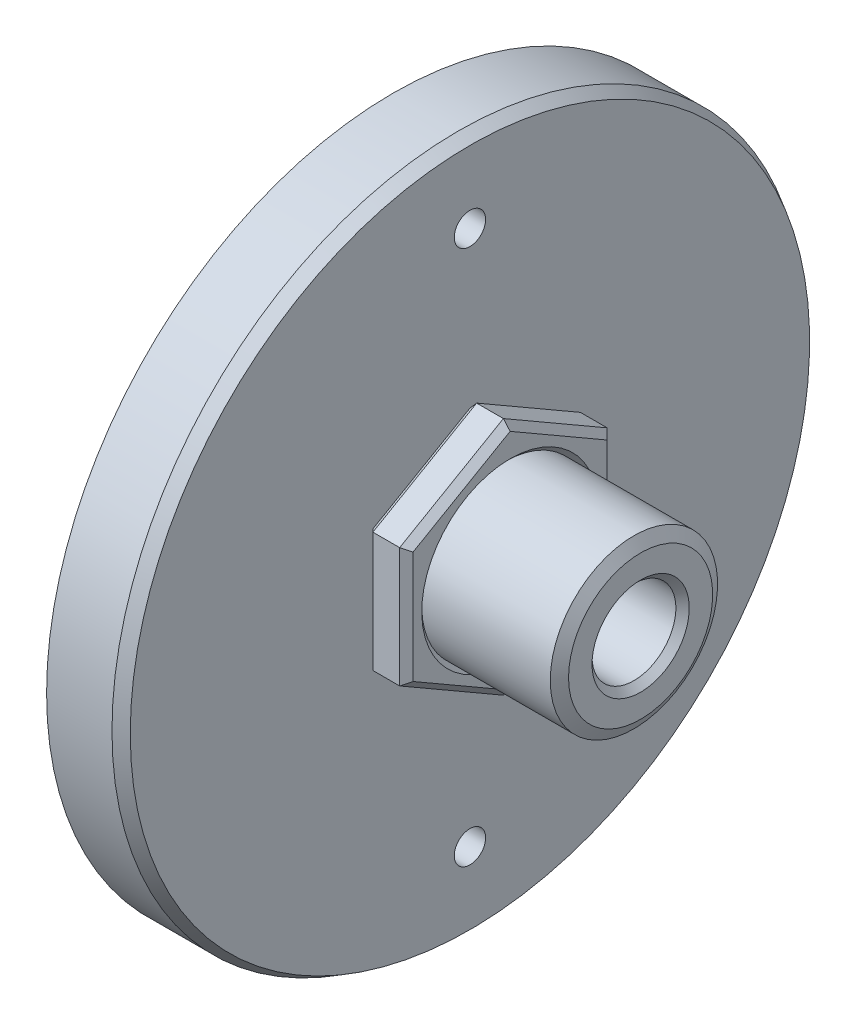
ISO-10303-21;
HEADER;
FILE_DESCRIPTION(('STEP AP214'),'2;1');
FILE_NAME('part.step','',(''),(''),'','','');
FILE_SCHEMA(('AUTOMOTIVE_DESIGN { 1 0 10303 214 1 1 1 1 }'));
ENDSEC;
DATA;
#1=APPLICATION_CONTEXT('core data for automotive mechanical design processes');
#2=APPLICATION_PROTOCOL_DEFINITION('international standard','automotive_design',2000,#1);
#3=PRODUCT_CONTEXT('',#1,'mechanical');
#4=PRODUCT('Part','Part','',(#3));
#5=PRODUCT_RELATED_PRODUCT_CATEGORY('part','',(#4));
#6=PRODUCT_DEFINITION_FORMATION('','',#4);
#7=PRODUCT_DEFINITION_CONTEXT('part definition',#1,'design');
#8=PRODUCT_DEFINITION('design','',#6,#7);
#9=PRODUCT_DEFINITION_SHAPE('','',#8);
#10=(LENGTH_UNIT() NAMED_UNIT(*) SI_UNIT(.MILLI.,.METRE.));
#11=(NAMED_UNIT(*) PLANE_ANGLE_UNIT() SI_UNIT($,.RADIAN.));
#12=(NAMED_UNIT(*) SI_UNIT($,.STERADIAN.) SOLID_ANGLE_UNIT());
#13=UNCERTAINTY_MEASURE_WITH_UNIT(LENGTH_MEASURE(1.E-05),#10,'distance_accuracy_value','');
#14=(GEOMETRIC_REPRESENTATION_CONTEXT(3) GLOBAL_UNCERTAINTY_ASSIGNED_CONTEXT((#13)) GLOBAL_UNIT_ASSIGNED_CONTEXT((#10,
#11,#12)) REPRESENTATION_CONTEXT('',''));
#15=CARTESIAN_POINT('',(0.,0.,0.));
#16=DIRECTION('',(0.,0.,1.));
#17=DIRECTION('',(1.,0.,0.));
#18=AXIS2_PLACEMENT_3D('',#15,#16,#17);
#19=CARTESIAN_POINT('',(0.,-4.54605601959911,0.));
#20=DIRECTION('',(0.,0.866025403784439,-0.499999999999999));
#21=DIRECTION('',(0.,-0.499999999999999,-0.866025403784439));
#22=AXIS2_PLACEMENT_3D('',#19,#20,#21);
#23=PLANE('',#22);
#24=DIRECTION('',(1.,0.,0.));
#25=VECTOR('',#24,1.);
#26=CARTESIAN_POINT('',(0.,-4.54605601959911,0.));
#27=LINE('',#26,#25);
#28=CARTESIAN_POINT('',(0.254000000000003,-4.54605601959911,0.));
#29=VERTEX_POINT('',#28);
#30=CARTESIAN_POINT('',(1.27,-4.54605601959911,0.));
#31=VERTEX_POINT('',#30);
#32=EDGE_CURVE('P0_E212',#29,#31,#27,.T.);
#33=ORIENTED_EDGE('',*,*,#32,.T.);
#34=DIRECTION('',(0.,0.499999999999999,0.866025403784439));
#35=VECTOR('',#34,1.);
#36=CARTESIAN_POINT('',(1.27,-4.54605601959911,0.));
#37=LINE('',#36,#35);
#38=CARTESIAN_POINT('',(1.27,-2.27302800979957,3.93699999999999));
#39=VERTEX_POINT('',#38);
#40=EDGE_CURVE('P0_E178',#31,#39,#37,.T.);
#41=ORIENTED_EDGE('',*,*,#40,.T.);
#42=DIRECTION('',(1.,0.,0.));
#43=VECTOR('',#42,1.);
#44=CARTESIAN_POINT('',(0.,-2.27302800979957,3.93699999999999));
#45=LINE('',#44,#43);
#46=CARTESIAN_POINT('',(0.254000000000003,-2.27302800979957,3.93699999999999));
#47=VERTEX_POINT('',#46);
#48=EDGE_CURVE('P0_E128',#47,#39,#45,.T.);
#49=ORIENTED_EDGE('',*,*,#48,.F.);
#50=DIRECTION('',(0.,-0.499999999999999,-0.866025403784439));
#51=VECTOR('',#50,1.);
#52=CARTESIAN_POINT('',(0.254000000000003,-4.54605601959911,0.));
#53=LINE('',#52,#51);
#54=EDGE_CURVE('P0_E176',#47,#29,#53,.T.);
#55=ORIENTED_EDGE('',*,*,#54,.T.);
#56=EDGE_LOOP('',(#33,#41,#49,#55));
#57=FACE_BOUND('',#56,.T.);
#58=ADVANCED_FACE('P0_F16',(#57),#23,.F.);
#59=CARTESIAN_POINT('',(0.,-2.27302800979957,3.93699999999999));
#60=DIRECTION('',(0.,0.,-1.));
#61=DIRECTION('',(0.,-1.,0.));
#62=AXIS2_PLACEMENT_3D('',#59,#60,#61);
#63=PLANE('',#62);
#64=ORIENTED_EDGE('',*,*,#48,.T.);
#65=DIRECTION('',(0.,1.,0.));
#66=VECTOR('',#65,1.);
#67=CARTESIAN_POINT('',(1.27,-2.27302800979957,3.93699999999999));
#68=LINE('',#67,#66);
#69=CARTESIAN_POINT('',(1.27,2.27302800979956,3.93699999999999));
#70=VERTEX_POINT('',#69);
#71=EDGE_CURVE('P0_E127',#39,#70,#68,.T.);
#72=ORIENTED_EDGE('',*,*,#71,.T.);
#73=DIRECTION('',(1.,0.,0.));
#74=VECTOR('',#73,1.);
#75=CARTESIAN_POINT('',(0.,2.27302800979956,3.93699999999999));
#76=LINE('',#75,#74);
#77=CARTESIAN_POINT('',(0.254000000000003,2.27302800979956,3.93699999999999));
#78=VERTEX_POINT('',#77);
#79=EDGE_CURVE('P0_E109',#78,#70,#76,.T.);
#80=ORIENTED_EDGE('',*,*,#79,.F.);
#81=DIRECTION('',(0.,-1.,0.));
#82=VECTOR('',#81,1.);
#83=CARTESIAN_POINT('',(0.254000000000003,-2.27302800979957,3.93699999999999));
#84=LINE('',#83,#82);
#85=EDGE_CURVE('P0_E124',#78,#47,#84,.T.);
#86=ORIENTED_EDGE('',*,*,#85,.T.);
#87=EDGE_LOOP('',(#64,#72,#80,#86));
#88=FACE_BOUND('',#87,.T.);
#89=ADVANCED_FACE('P0_F122',(#88),#63,.F.);
#90=CARTESIAN_POINT('',(0.,2.27302800979956,3.93699999999999));
#91=DIRECTION('',(0.,-0.866025403784438,-0.500000000000001));
#92=DIRECTION('',(1.,0.,0.));
#93=AXIS2_PLACEMENT_3D('',#90,#91,#92);
#94=PLANE('',#93);
#95=ORIENTED_EDGE('',*,*,#79,.T.);
#96=DIRECTION('',(0.,0.500000000000001,-0.866025403784438));
#97=VECTOR('',#96,1.);
#98=CARTESIAN_POINT('',(1.27,2.27302800979956,3.93699999999999));
#99=LINE('',#98,#97);
#100=CARTESIAN_POINT('',(1.27,4.54605601959912,0.));
#101=VERTEX_POINT('',#100);
#102=EDGE_CURVE('P0_E116',#70,#101,#99,.T.);
#103=ORIENTED_EDGE('',*,*,#102,.T.);
#104=DIRECTION('',(1.,0.,0.));
#105=VECTOR('',#104,1.);
#106=CARTESIAN_POINT('',(0.,4.54605601959912,0.));
#107=LINE('',#106,#105);
#108=CARTESIAN_POINT('',(0.254000000000003,4.54605601959912,0.));
#109=VERTEX_POINT('',#108);
#110=EDGE_CURVE('P0_E111',#109,#101,#107,.T.);
#111=ORIENTED_EDGE('',*,*,#110,.F.);
#112=DIRECTION('',(0.,-0.500000000000001,0.866025403784438));
#113=VECTOR('',#112,1.);
#114=CARTESIAN_POINT('',(0.254000000000003,2.27302800979956,3.93699999999999));
#115=LINE('',#114,#113);
#116=EDGE_CURVE('P0_E106',#109,#78,#115,.T.);
#117=ORIENTED_EDGE('',*,*,#116,.T.);
#118=EDGE_LOOP('',(#95,#103,#111,#117));
#119=FACE_BOUND('',#118,.T.);
#120=ADVANCED_FACE('P0_F108',(#119),#94,.F.);
#121=CARTESIAN_POINT('',(0.,4.54605601959912,0.));
#122=DIRECTION('',(0.,-0.866025403784439,0.499999999999999));
#123=DIRECTION('',(0.,0.499999999999999,0.866025403784439));
#124=AXIS2_PLACEMENT_3D('',#121,#122,#123);
#125=PLANE('',#124);
#126=ORIENTED_EDGE('',*,*,#110,.T.);
#127=DIRECTION('',(0.,-0.499999999999999,-0.866025403784439));
#128=VECTOR('',#127,1.);
#129=CARTESIAN_POINT('',(1.27,4.54605601959912,0.));
#130=LINE('',#129,#128);
#131=CARTESIAN_POINT('',(1.27,2.27302800979956,-3.937));
#132=VERTEX_POINT('',#131);
#133=EDGE_CURVE('P0_E165',#101,#132,#130,.T.);
#134=ORIENTED_EDGE('',*,*,#133,.T.);
#135=DIRECTION('',(1.,0.,0.));
#136=VECTOR('',#135,1.);
#137=CARTESIAN_POINT('',(0.,2.27302800979956,-3.937));
#138=LINE('',#137,#136);
#139=CARTESIAN_POINT('',(0.254000000000003,2.27302800979956,-3.937));
#140=VERTEX_POINT('',#139);
#141=EDGE_CURVE('P0_E230',#140,#132,#138,.T.);
#142=ORIENTED_EDGE('',*,*,#141,.F.);
#143=DIRECTION('',(0.,0.499999999999999,0.866025403784439));
#144=VECTOR('',#143,1.);
#145=CARTESIAN_POINT('',(0.254000000000003,4.54605601959912,0.));
#146=LINE('',#145,#144);
#147=EDGE_CURVE('P0_E163',#140,#109,#146,.T.);
#148=ORIENTED_EDGE('',*,*,#147,.T.);
#149=EDGE_LOOP('',(#126,#134,#142,#148));
#150=FACE_BOUND('',#149,.T.);
#151=ADVANCED_FACE('P0_F227',(#150),#125,.F.);
#152=CARTESIAN_POINT('',(0.,2.27302800979956,-3.937));
#153=DIRECTION('',(0.,0.,1.));
#154=DIRECTION('',(0.,1.,0.));
#155=AXIS2_PLACEMENT_3D('',#152,#153,#154);
#156=PLANE('',#155);
#157=ORIENTED_EDGE('',*,*,#141,.T.);
#158=DIRECTION('',(0.,-1.,0.));
#159=VECTOR('',#158,1.);
#160=CARTESIAN_POINT('',(1.27,2.27302800979956,-3.937));
#161=LINE('',#160,#159);
#162=CARTESIAN_POINT('',(1.27,-2.27302800979955,-3.93700000000001));
#163=VERTEX_POINT('',#162);
#164=EDGE_CURVE('P0_E169',#132,#163,#161,.T.);
#165=ORIENTED_EDGE('',*,*,#164,.T.);
#166=DIRECTION('',(1.,0.,0.));
#167=VECTOR('',#166,1.);
#168=CARTESIAN_POINT('',(0.,-2.27302800979955,-3.93700000000001));
#169=LINE('',#168,#167);
#170=CARTESIAN_POINT('',(0.254000000000003,-2.27302800979955,-3.93700000000001));
#171=VERTEX_POINT('',#170);
#172=EDGE_CURVE('P0_E233',#171,#163,#169,.T.);
#173=ORIENTED_EDGE('',*,*,#172,.F.);
#174=DIRECTION('',(0.,1.,0.));
#175=VECTOR('',#174,1.);
#176=CARTESIAN_POINT('',(0.254000000000003,2.27302800979956,-3.937));
#177=LINE('',#176,#175);
#178=EDGE_CURVE('P0_E167',#171,#140,#177,.T.);
#179=ORIENTED_EDGE('',*,*,#178,.T.);
#180=EDGE_LOOP('',(#157,#165,#173,#179));
#181=FACE_BOUND('',#180,.T.);
#182=ADVANCED_FACE('P0_F272',(#181),#156,.F.);
#183=CARTESIAN_POINT('',(0.,-2.27302800979955,-3.93700000000001));
#184=DIRECTION('',(0.,0.866025403784438,0.500000000000001));
#185=DIRECTION('',(0.,0.500000000000001,-0.866025403784438));
#186=AXIS2_PLACEMENT_3D('',#183,#184,#185);
#187=PLANE('',#186);
#188=ORIENTED_EDGE('',*,*,#172,.T.);
#189=DIRECTION('',(0.,-0.500000000000001,0.866025403784438));
#190=VECTOR('',#189,1.);
#191=CARTESIAN_POINT('',(1.27,-2.27302800979955,-3.93700000000001));
#192=LINE('',#191,#190);
#193=EDGE_CURVE('P0_E174',#163,#31,#192,.T.);
#194=ORIENTED_EDGE('',*,*,#193,.T.);
#195=ORIENTED_EDGE('',*,*,#32,.F.);
#196=DIRECTION('',(0.,0.500000000000001,-0.866025403784438));
#197=VECTOR('',#196,1.);
#198=CARTESIAN_POINT('',(0.254000000000003,-2.27302800979955,-3.93700000000001));
#199=LINE('',#198,#197);
#200=EDGE_CURVE('P0_E171',#29,#171,#199,.T.);
#201=ORIENTED_EDGE('',*,*,#200,.T.);
#202=EDGE_LOOP('',(#188,#194,#195,#201));
#203=FACE_BOUND('',#202,.T.);
#204=ADVANCED_FACE('P0_F273',(#203),#187,.F.);
#205=CARTESIAN_POINT('',(0.,-2.27302800979957,3.93699999999999));
#206=DIRECTION('',(-1.,0.,0.));
#207=DIRECTION('',(0.,-0.500000000000001,0.866025403784438));
#208=AXIS2_PLACEMENT_3D('',#205,#206,#207);
#209=PLANE('',#208);
#210=DIRECTION('',(0.,-1.,0.));
#211=VECTOR('',#210,1.);
#212=CARTESIAN_POINT('',(0.,-2.27302800979955,-3.68300000000001));
#213=LINE('',#212,#211);
#214=CARTESIAN_POINT('',(0.,2.1263810414254,-3.683));
#215=VERTEX_POINT('',#214);
#216=CARTESIAN_POINT('',(0.,-2.12638104142538,-3.68300000000001));
#217=VERTEX_POINT('',#216);
#218=EDGE_CURVE('P0_E25',#215,#217,#213,.T.);
#219=ORIENTED_EDGE('',*,*,#218,.T.);
#220=DIRECTION('',(0.,-0.500000000000001,0.866025403784438));
#221=VECTOR('',#220,1.);
#222=CARTESIAN_POINT('',(0.,-4.32608556703787,0.127000000000005));
#223=LINE('',#222,#221);
#224=CARTESIAN_POINT('',(0.,-4.25276208285078,0.));
#225=VERTEX_POINT('',#224);
#226=EDGE_CURVE('P0_E11',#217,#225,#223,.T.);
#227=ORIENTED_EDGE('',*,*,#226,.T.);
#228=DIRECTION('',(0.,0.499999999999999,0.866025403784439));
#229=VECTOR('',#228,1.);
#230=CARTESIAN_POINT('',(0.,-2.05305755723832,3.80999999999999));
#231=LINE('',#230,#229);
#232=CARTESIAN_POINT('',(0.,-2.1263810414254,3.68299999999999));
#233=VERTEX_POINT('',#232);
#234=EDGE_CURVE('P0_E189',#225,#233,#231,.T.);
#235=ORIENTED_EDGE('',*,*,#234,.T.);
#236=DIRECTION('',(0.,1.,0.));
#237=VECTOR('',#236,1.);
#238=CARTESIAN_POINT('',(0.,2.27302800979956,3.68299999999999));
#239=LINE('',#238,#237);
#240=CARTESIAN_POINT('',(0.,2.12638104142539,3.68299999999999));
#241=VERTEX_POINT('',#240);
#242=EDGE_CURVE('P0_E191',#233,#241,#239,.T.);
#243=ORIENTED_EDGE('',*,*,#242,.T.);
#244=DIRECTION('',(0.,0.500000000000001,-0.866025403784438));
#245=VECTOR('',#244,1.);
#246=CARTESIAN_POINT('',(0.,4.32608556703787,-0.127));
#247=LINE('',#246,#245);
#248=CARTESIAN_POINT('',(0.,4.25276208285079,0.));
#249=VERTEX_POINT('',#248);
#250=EDGE_CURVE('P0_E134',#241,#249,#247,.T.);
#251=ORIENTED_EDGE('',*,*,#250,.T.);
#252=DIRECTION('',(0.,-0.499999999999999,-0.866025403784439));
#253=VECTOR('',#252,1.);
#254=CARTESIAN_POINT('',(0.,2.05305755723832,-3.81000000000001));
#255=LINE('',#254,#253);
#256=EDGE_CURVE('P0_E36',#249,#215,#255,.T.);
#257=ORIENTED_EDGE('',*,*,#256,.T.);
#258=EDGE_LOOP('',(#219,#227,#235,#243,#251,#257));
#259=FACE_BOUND('',#258,.T.);
#260=CARTESIAN_POINT('',(0.,0.,0.));
#261=DIRECTION('',(-1.,0.,0.));
#262=DIRECTION('',(0.,-0.500000000000001,0.866025403784438));
#263=AXIS2_PLACEMENT_3D('',#260,#261,#262);
#264=CIRCLE('',#263,3.35280000000001);
#265=CARTESIAN_POINT('',(0.,-1.67640000000001,2.90360997380847));
#266=VERTEX_POINT('',#265);
#267=EDGE_CURVE('P0_E186',#266,#266,#264,.F.);
#268=ORIENTED_EDGE('',*,*,#267,.T.);
#269=EDGE_LOOP('',(#268));
#270=FACE_BOUND('',#269,.T.);
#271=ADVANCED_FACE('P0_F281',(#259,#270),#209,.T.);
#272=CARTESIAN_POINT('',(1.524,-2.27302800979957,3.93699999999999));
#273=DIRECTION('',(-1.,0.,0.));
#274=DIRECTION('',(0.,-0.500000000000001,0.866025403784438));
#275=AXIS2_PLACEMENT_3D('',#272,#273,#274);
#276=PLANE('',#275);
#277=DIRECTION('',(0.,-0.500000000000001,0.866025403784438));
#278=VECTOR('',#277,1.);
#279=CARTESIAN_POINT('',(1.524,0.916543552338524,5.7785));
#280=LINE('',#279,#278);
#281=CARTESIAN_POINT('',(1.524,4.25276208285079,0.));
#282=VERTEX_POINT('',#281);
#283=CARTESIAN_POINT('',(1.524,2.12638104142539,3.68299999999999));
#284=VERTEX_POINT('',#283);
#285=EDGE_CURVE('P0_E158',#282,#284,#280,.T.);
#286=ORIENTED_EDGE('',*,*,#285,.T.);
#287=DIRECTION('',(0.,-1.,0.));
#288=VECTOR('',#287,1.);
#289=CARTESIAN_POINT('',(1.524,-2.27302800979957,3.68299999999999));
#290=LINE('',#289,#288);
#291=CARTESIAN_POINT('',(1.524,-2.12638104142541,3.68299999999999));
#292=VERTEX_POINT('',#291);
#293=EDGE_CURVE('P0_E117',#284,#292,#290,.T.);
#294=ORIENTED_EDGE('',*,*,#293,.T.);
#295=DIRECTION('',(0.,-0.499999999999999,-0.866025403784439));
#296=VECTOR('',#295,1.);
#297=CARTESIAN_POINT('',(1.524,-2.05305755723832,3.80999999999999));
#298=LINE('',#297,#296);
#299=CARTESIAN_POINT('',(1.524,-4.25276208285078,0.));
#300=VERTEX_POINT('',#299);
#301=EDGE_CURVE('P0_E150',#292,#300,#298,.T.);
#302=ORIENTED_EDGE('',*,*,#301,.T.);
#303=DIRECTION('',(0.,0.500000000000001,-0.866025403784438));
#304=VECTOR('',#303,1.);
#305=CARTESIAN_POINT('',(1.524,-5.46259957193764,2.0955));
#306=LINE('',#305,#304);
#307=CARTESIAN_POINT('',(1.524,-2.12638104142538,-3.68300000000001));
#308=VERTEX_POINT('',#307);
#309=EDGE_CURVE('P0_E152',#300,#308,#306,.T.);
#310=ORIENTED_EDGE('',*,*,#309,.T.);
#311=DIRECTION('',(0.,1.,0.));
#312=VECTOR('',#311,1.);
#313=CARTESIAN_POINT('',(1.524,-2.27302800979956,-3.68300000000001));
#314=LINE('',#313,#312);
#315=CARTESIAN_POINT('',(1.524,2.1263810414254,-3.683));
#316=VERTEX_POINT('',#315);
#317=EDGE_CURVE('P0_E154',#308,#316,#314,.T.);
#318=ORIENTED_EDGE('',*,*,#317,.T.);
#319=DIRECTION('',(0.,0.499999999999999,0.866025403784439));
#320=VECTOR('',#319,1.);
#321=CARTESIAN_POINT('',(1.524,4.32608556703787,0.126999999999995));
#322=LINE('',#321,#320);
#323=EDGE_CURVE('P0_E156',#316,#282,#322,.T.);
#324=ORIENTED_EDGE('',*,*,#323,.T.);
#325=EDGE_LOOP('',(#286,#294,#302,#310,#318,#324));
#326=FACE_BOUND('',#325,.T.);
#327=CARTESIAN_POINT('',(1.524,0.,0.));
#328=DIRECTION('',(-1.,0.,0.));
#329=DIRECTION('',(0.,-0.500000000000001,0.866025403784438));
#330=AXIS2_PLACEMENT_3D('',#327,#328,#329);
#331=CIRCLE('',#330,3.35279999999999);
#332=CARTESIAN_POINT('',(1.524,-1.6764,2.90360997380846));
#333=VERTEX_POINT('',#332);
#334=EDGE_CURVE('P0_E144',#333,#333,#331,.T.);
#335=ORIENTED_EDGE('',*,*,#334,.T.);
#336=EDGE_LOOP('',(#335));
#337=FACE_BOUND('',#336,.T.);
#338=ADVANCED_FACE('P0_F284',(#326,#337),#276,.F.);
#339=CARTESIAN_POINT('',(1.524,0.,0.));
#340=DIRECTION('',(-1.,0.,0.));
#341=DIRECTION('',(0.,-0.500000000000001,0.866025403784438));
#342=AXIS2_PLACEMENT_3D('',#339,#340,#341);
#343=CYLINDRICAL_SURFACE('',#342,3.0988);
#344=CARTESIAN_POINT('',(1.27000000000001,0.,0.));
#345=DIRECTION('',(-1.,0.,0.));
#346=DIRECTION('',(0.,-0.500000000000001,0.866025403784438));
#347=AXIS2_PLACEMENT_3D('',#344,#345,#346);
#348=CIRCLE('',#347,3.0988);
#349=CARTESIAN_POINT('',(1.27000000000001,-1.5494,2.68363952124722));
#350=VERTEX_POINT('',#349);
#351=EDGE_CURVE('P0_E183',#350,#350,#348,.F.);
#352=ORIENTED_EDGE('',*,*,#351,.T.);
#353=EDGE_LOOP('',(#352));
#354=FACE_BOUND('',#353,.T.);
#355=CARTESIAN_POINT('',(0.254000000000006,0.,0.));
#356=DIRECTION('',(-1.,0.,0.));
#357=DIRECTION('',(0.,-0.500000000000001,0.866025403784438));
#358=AXIS2_PLACEMENT_3D('',#355,#356,#357);
#359=CIRCLE('',#358,3.0988);
#360=CARTESIAN_POINT('',(0.254000000000006,-1.5494,2.68363952124722));
#361=VERTEX_POINT('',#360);
#362=EDGE_CURVE('P0_E180',#361,#361,#359,.T.);
#363=ORIENTED_EDGE('',*,*,#362,.T.);
#364=EDGE_LOOP('',(#363));
#365=FACE_BOUND('',#364,.T.);
#366=ADVANCED_FACE('P0_F292',(#354,#365),#343,.F.);
#367=CARTESIAN_POINT('',(1.27,2.27302800979956,-3.937));
#368=DIRECTION('',(-0.70710678118655,0.,0.707106781186545));
#369=DIRECTION('',(0.654653670707975,-0.377964473009229,0.654653670707979));
#370=AXIS2_PLACEMENT_3D('',#367,#368,#369);
#371=PLANE('',#370);
#372=DIRECTION('',(0.654653670707976,-0.377964473009225,0.65465367070798));
#373=VECTOR('',#372,1.);
#374=CARTESIAN_POINT('',(1.27,2.27302800979956,-3.937));
#375=LINE('',#374,#373);
#376=EDGE_CURVE('P0_E206',#316,#132,#375,.F.);
#377=ORIENTED_EDGE('',*,*,#376,.F.);
#378=ORIENTED_EDGE('',*,*,#317,.F.);
#379=DIRECTION('',(0.654653670707975,0.377964473009228,0.654653670707979));
#380=VECTOR('',#379,1.);
#381=CARTESIAN_POINT('',(1.27,-2.27302800979955,-3.93700000000001));
#382=LINE('',#381,#380);
#383=EDGE_CURVE('P0_E209',#163,#308,#382,.T.);
#384=ORIENTED_EDGE('',*,*,#383,.F.);
#385=ORIENTED_EDGE('',*,*,#164,.F.);
#386=EDGE_LOOP('',(#377,#378,#384,#385));
#387=FACE_BOUND('',#386,.T.);
#388=ADVANCED_FACE('P0_F269',(#387),#371,.F.);
#389=CARTESIAN_POINT('',(1.27,-2.27302800979955,-3.93700000000001));
#390=DIRECTION('',(-0.70710678118655,0.612372435695792,0.353553390593273));
#391=DIRECTION('',(-0.707106781186545,-0.612372435695796,-0.353553390593276));
#392=AXIS2_PLACEMENT_3D('',#389,#390,#391);
#393=PLANE('',#392);
#394=ORIENTED_EDGE('',*,*,#383,.T.);
#395=ORIENTED_EDGE('',*,*,#309,.F.);
#396=DIRECTION('',(0.654653670707975,0.755928946018456,0.));
#397=VECTOR('',#396,1.);
#398=CARTESIAN_POINT('',(1.27,-4.54605601959911,0.));
#399=LINE('',#398,#397);
#400=EDGE_CURVE('P0_E203',#31,#300,#399,.T.);
#401=ORIENTED_EDGE('',*,*,#400,.F.);
#402=ORIENTED_EDGE('',*,*,#193,.F.);
#403=EDGE_LOOP('',(#394,#395,#401,#402));
#404=FACE_BOUND('',#403,.T.);
#405=ADVANCED_FACE('P0_F249',(#404),#393,.F.);
#406=CARTESIAN_POINT('',(1.27,4.54605601959912,0.));
#407=DIRECTION('',(-0.707106781186547,-0.612372435695795,0.353553390593273));
#408=DIRECTION('',(0.654653670707977,-0.377964473009228,0.654653670707977));
#409=AXIS2_PLACEMENT_3D('',#406,#407,#408);
#410=PLANE('',#409);
#411=ORIENTED_EDGE('',*,*,#376,.T.);
#412=ORIENTED_EDGE('',*,*,#133,.F.);
#413=DIRECTION('',(0.654653670707976,-0.755928946018456,0.));
#414=VECTOR('',#413,1.);
#415=CARTESIAN_POINT('',(1.27,4.54605601959912,0.));
#416=LINE('',#415,#414);
#417=EDGE_CURVE('P0_E200',#282,#101,#416,.F.);
#418=ORIENTED_EDGE('',*,*,#417,.F.);
#419=ORIENTED_EDGE('',*,*,#323,.F.);
#420=EDGE_LOOP('',(#411,#412,#418,#419));
#421=FACE_BOUND('',#420,.T.);
#422=ADVANCED_FACE('P0_F265',(#421),#410,.F.);
#423=CARTESIAN_POINT('',(1.27,-4.54605601959911,0.));
#424=DIRECTION('',(-0.707106781186549,0.612372435695794,-0.353553390593272));
#425=DIRECTION('',(-0.654653670707976,-0.377964473009229,0.654653670707978));
#426=AXIS2_PLACEMENT_3D('',#423,#424,#425);
#427=PLANE('',#426);
#428=ORIENTED_EDGE('',*,*,#400,.T.);
#429=ORIENTED_EDGE('',*,*,#301,.F.);
#430=DIRECTION('',(-0.654653670707975,-0.377964473009228,0.654653670707979));
#431=VECTOR('',#430,1.);
#432=CARTESIAN_POINT('',(2.39485714285714,-1.62359143557112,2.81214285714284));
#433=LINE('',#432,#431);
#434=EDGE_CURVE('P0_E198',#39,#292,#433,.F.);
#435=ORIENTED_EDGE('',*,*,#434,.F.);
#436=ORIENTED_EDGE('',*,*,#40,.F.);
#437=EDGE_LOOP('',(#428,#429,#435,#436));
#438=FACE_BOUND('',#437,.T.);
#439=ADVANCED_FACE('P0_F253',(#438),#427,.F.);
#440=CARTESIAN_POINT('',(1.27,2.27302800979956,3.93699999999999));
#441=DIRECTION('',(-0.70710678118655,-0.612372435695792,-0.353553390593273));
#442=DIRECTION('',(0.707106781186545,-0.612372435695796,-0.353553390593276));
#443=AXIS2_PLACEMENT_3D('',#440,#441,#442);
#444=PLANE('',#443);
#445=ORIENTED_EDGE('',*,*,#417,.T.);
#446=ORIENTED_EDGE('',*,*,#102,.F.);
#447=DIRECTION('',(0.654653670707975,-0.377964473009228,-0.654653670707979));
#448=VECTOR('',#447,1.);
#449=CARTESIAN_POINT('',(1.27,2.27302800979956,3.93699999999999));
#450=LINE('',#449,#448);
#451=EDGE_CURVE('P0_E196',#284,#70,#450,.F.);
#452=ORIENTED_EDGE('',*,*,#451,.F.);
#453=ORIENTED_EDGE('',*,*,#285,.F.);
#454=EDGE_LOOP('',(#445,#446,#452,#453));
#455=FACE_BOUND('',#454,.T.);
#456=ADVANCED_FACE('P0_F261',(#455),#444,.F.);
#457=CARTESIAN_POINT('',(1.27,-2.27302800979957,3.93699999999999));
#458=DIRECTION('',(-0.70710678118655,0.,-0.707106781186545));
#459=DIRECTION('',(-0.654653670707975,-0.377964473009229,0.654653670707979));
#460=AXIS2_PLACEMENT_3D('',#457,#458,#459);
#461=PLANE('',#460);
#462=ORIENTED_EDGE('',*,*,#434,.T.);
#463=ORIENTED_EDGE('',*,*,#293,.F.);
#464=ORIENTED_EDGE('',*,*,#451,.T.);
#465=ORIENTED_EDGE('',*,*,#71,.F.);
#466=EDGE_LOOP('',(#462,#463,#464,#465));
#467=FACE_BOUND('',#466,.T.);
#468=ADVANCED_FACE('P0_F256',(#467),#461,.F.);
#469=CARTESIAN_POINT('',(1.524,0.,0.));
#470=DIRECTION('',(1.,0.,0.));
#471=DIRECTION('',(0.,0.500000000000001,-0.866025403784438));
#472=AXIS2_PLACEMENT_3D('',#469,#470,#471);
#473=CONICAL_SURFACE('',#472,3.35279999999999,0.785398163397449);
#474=ORIENTED_EDGE('',*,*,#351,.F.);
#475=EDGE_LOOP('',(#474));
#476=FACE_BOUND('',#475,.T.);
#477=ORIENTED_EDGE('',*,*,#334,.F.);
#478=EDGE_LOOP('',(#477));
#479=FACE_BOUND('',#478,.T.);
#480=ADVANCED_FACE('P0_F317',(#476,#479),#473,.F.);
#481=CARTESIAN_POINT('',(0.,0.916543552338524,5.7785));
#482=DIRECTION('',(-0.707106781186545,0.612372435695796,0.353553390593276));
#483=DIRECTION('',(-0.70710678118655,-0.612372435695792,-0.353553390593273));
#484=AXIS2_PLACEMENT_3D('',#481,#482,#483);
#485=PLANE('',#484);
#486=DIRECTION('',(-0.65465367070798,-0.377964473009226,-0.654653670707975));
#487=VECTOR('',#486,1.);
#488=CARTESIAN_POINT('',(-1.08857142857143,1.49789403410755,2.59442857142857));
#489=LINE('',#488,#487);
#490=EDGE_CURVE('P0_E132',#78,#241,#489,.T.);
#491=ORIENTED_EDGE('',*,*,#490,.F.);
#492=ORIENTED_EDGE('',*,*,#116,.F.);
#493=DIRECTION('',(-0.654653670707981,-0.755928946018451,0.));
#494=VECTOR('',#493,1.);
#495=CARTESIAN_POINT('',(-1.65099999999999,2.34635149398668,0.));
#496=LINE('',#495,#494);
#497=EDGE_CURVE('P0_E20',#249,#109,#496,.F.);
#498=ORIENTED_EDGE('',*,*,#497,.F.);
#499=ORIENTED_EDGE('',*,*,#250,.F.);
#500=EDGE_LOOP('',(#491,#492,#498,#499));
#501=FACE_BOUND('',#500,.T.);
#502=ADVANCED_FACE('P0_F133',(#501),#485,.T.);
#503=CARTESIAN_POINT('',(0.,4.32608556703787,0.126999999999995));
#504=DIRECTION('',(-0.707106781186543,0.612372435695799,-0.353553390593275));
#505=DIRECTION('',(-0.654653670707982,-0.377964473009226,0.654653670707973));
#506=AXIS2_PLACEMENT_3D('',#503,#504,#505);
#507=PLANE('',#506);
#508=ORIENTED_EDGE('',*,*,#497,.T.);
#509=ORIENTED_EDGE('',*,*,#147,.F.);
#510=DIRECTION('',(-0.654653670707981,-0.377964473009223,0.654653670707976));
#511=VECTOR('',#510,1.);
#512=CARTESIAN_POINT('',(-1.08857142857144,1.49789403410756,-2.59442857142857));
#513=LINE('',#512,#511);
#514=EDGE_CURVE('P0_E137',#215,#140,#513,.F.);
#515=ORIENTED_EDGE('',*,*,#514,.F.);
#516=ORIENTED_EDGE('',*,*,#256,.F.);
#517=EDGE_LOOP('',(#508,#509,#515,#516));
#518=FACE_BOUND('',#517,.T.);
#519=ADVANCED_FACE('P0_F224',(#518),#507,.T.);
#520=CARTESIAN_POINT('',(0.,-2.27302800979957,3.68299999999999));
#521=DIRECTION('',(-0.707106781186545,0.,0.70710678118655));
#522=DIRECTION('',(0.65465367070798,-0.377964473009227,0.654653670707975));
#523=AXIS2_PLACEMENT_3D('',#520,#521,#522);
#524=PLANE('',#523);
#525=ORIENTED_EDGE('',*,*,#490,.T.);
#526=ORIENTED_EDGE('',*,*,#242,.F.);
#527=DIRECTION('',(-0.65465367070798,0.377964473009225,-0.654653670707975));
#528=VECTOR('',#527,1.);
#529=CARTESIAN_POINT('',(0.036285714285715,-2.147330608336,3.71928571428571));
#530=LINE('',#529,#528);
#531=EDGE_CURVE('P0_E141',#47,#233,#530,.T.);
#532=ORIENTED_EDGE('',*,*,#531,.F.);
#533=ORIENTED_EDGE('',*,*,#85,.F.);
#534=EDGE_LOOP('',(#525,#526,#532,#533));
#535=FACE_BOUND('',#534,.T.);
#536=ADVANCED_FACE('P0_F139',(#535),#524,.T.);
#537=CARTESIAN_POINT('',(0.,-2.27302800979957,-3.68300000000001));
#538=DIRECTION('',(-0.707106781186545,0.,-0.70710678118655));
#539=DIRECTION('',(-0.65465367070798,-0.377964473009227,0.654653670707975));
#540=AXIS2_PLACEMENT_3D('',#537,#538,#539);
#541=PLANE('',#540);
#542=ORIENTED_EDGE('',*,*,#514,.T.);
#543=ORIENTED_EDGE('',*,*,#178,.F.);
#544=DIRECTION('',(-0.65465367070798,0.377964473009226,0.654653670707975));
#545=VECTOR('',#544,1.);
#546=CARTESIAN_POINT('',(0.0362857142857196,-2.14733060833598,-3.71928571428573));
#547=LINE('',#546,#545);
#548=EDGE_CURVE('P0_E215',#217,#171,#547,.F.);
#549=ORIENTED_EDGE('',*,*,#548,.F.);
#550=ORIENTED_EDGE('',*,*,#218,.F.);
#551=EDGE_LOOP('',(#542,#543,#549,#550));
#552=FACE_BOUND('',#551,.T.);
#553=ADVANCED_FACE('P0_F221',(#552),#541,.T.);
#554=CARTESIAN_POINT('',(0.,-2.05305755723832,3.80999999999999));
#555=DIRECTION('',(-0.707106781186544,-0.612372435695798,0.353553390593275));
#556=DIRECTION('',(0.654653670707981,-0.377964473009226,0.654653670707974));
#557=AXIS2_PLACEMENT_3D('',#554,#555,#556);
#558=PLANE('',#557);
#559=ORIENTED_EDGE('',*,*,#531,.T.);
#560=ORIENTED_EDGE('',*,*,#234,.F.);
#561=DIRECTION('',(0.65465367070798,-0.755928946018452,0.));
#562=VECTOR('',#561,1.);
#563=CARTESIAN_POINT('',(-1.08857142857143,-2.99578806821509,0.));
#564=LINE('',#563,#562);
#565=EDGE_CURVE('P0_E213',#29,#225,#564,.F.);
#566=ORIENTED_EDGE('',*,*,#565,.F.);
#567=ORIENTED_EDGE('',*,*,#54,.F.);
#568=EDGE_LOOP('',(#559,#560,#566,#567));
#569=FACE_BOUND('',#568,.T.);
#570=ADVANCED_FACE('P0_F280',(#569),#558,.T.);
#571=CARTESIAN_POINT('',(0.,-5.46259957193764,2.0955));
#572=DIRECTION('',(-0.707106781186545,-0.612372435695796,-0.353553390593276));
#573=DIRECTION('',(0.70710678118655,-0.612372435695792,-0.353553390593273));
#574=AXIS2_PLACEMENT_3D('',#571,#572,#573);
#575=PLANE('',#574);
#576=ORIENTED_EDGE('',*,*,#548,.T.);
#577=ORIENTED_EDGE('',*,*,#200,.F.);
#578=ORIENTED_EDGE('',*,*,#565,.T.);
#579=ORIENTED_EDGE('',*,*,#226,.F.);
#580=EDGE_LOOP('',(#576,#577,#578,#579));
#581=FACE_BOUND('',#580,.T.);
#582=ADVANCED_FACE('P0_F276',(#581),#575,.T.);
#583=CARTESIAN_POINT('',(0.254000000000006,0.,0.));
#584=DIRECTION('',(-1.,0.,0.));
#585=DIRECTION('',(0.,-0.500000000000001,0.866025403784438));
#586=AXIS2_PLACEMENT_3D('',#583,#584,#585);
#587=CONICAL_SURFACE('',#586,3.0988,0.785398163397451);
#588=ORIENTED_EDGE('',*,*,#267,.F.);
#589=EDGE_LOOP('',(#588));
#590=FACE_BOUND('',#589,.T.);
#591=ORIENTED_EDGE('',*,*,#362,.F.);
#592=EDGE_LOOP('',(#591));
#593=FACE_BOUND('',#592,.T.);
#594=ADVANCED_FACE('P0_F18',(#590,#593),#587,.F.);
#595=CLOSED_SHELL('',(#58,#89,#120,#151,#182,#204,#271,#338,#366,#388,#405,#422,#439,#456,#468,
#480,#502,#519,#536,#553,#570,#582,#594));
#596=MANIFOLD_SOLID_BREP('P0_B1',#595);
#597=CARTESIAN_POINT('',(-3.175,0.,0.));
#598=DIRECTION('',(-1.,0.,0.));
#599=DIRECTION('',(0.,0.,1.));
#600=AXIS2_PLACEMENT_3D('',#597,#598,#599);
#601=PLANE('',#600);
#602=CARTESIAN_POINT('',(-3.175,0.,0.));
#603=DIRECTION('',(-1.,0.,0.));
#604=DIRECTION('',(0.,0.,1.));
#605=AXIS2_PLACEMENT_3D('',#602,#603,#604);
#606=CIRCLE('',#605,2.73505909487751);
#607=CARTESIAN_POINT('',(-3.175,0.,2.73505909487751));
#608=VERTEX_POINT('',#607);
#609=EDGE_CURVE('P1_E29',#608,#608,#606,.T.);
#610=ORIENTED_EDGE('',*,*,#609,.T.);
#611=EDGE_LOOP('',(#610));
#612=FACE_BOUND('',#611,.T.);
#613=CARTESIAN_POINT('',(-3.175,0.,0.));
#614=DIRECTION('',(-1.,0.,0.));
#615=DIRECTION('',(0.,0.,1.));
#616=AXIS2_PLACEMENT_3D('',#613,#614,#615);
#617=CIRCLE('',#616,1.84531);
#618=CARTESIAN_POINT('',(-3.175,0.,1.84531));
#619=VERTEX_POINT('',#618);
#620=EDGE_CURVE('P1_E34',#619,#619,#617,.F.);
#621=ORIENTED_EDGE('',*,*,#620,.T.);
#622=EDGE_LOOP('',(#621));
#623=FACE_BOUND('',#622,.T.);
#624=ADVANCED_FACE('P1_F14',(#612,#623),#601,.T.);
#625=CARTESIAN_POINT('',(6.477,0.,0.));
#626=DIRECTION('',(-1.,0.,0.));
#627=DIRECTION('',(0.,0.,1.));
#628=AXIS2_PLACEMENT_3D('',#625,#626,#627);
#629=PLANE('',#628);
#630=CARTESIAN_POINT('',(6.477,0.,0.));
#631=DIRECTION('',(-1.,0.,0.));
#632=DIRECTION('',(0.,0.,1.));
#633=AXIS2_PLACEMENT_3D('',#630,#631,#632);
#634=CIRCLE('',#633,2.73505909487751);
#635=CARTESIAN_POINT('',(6.477,0.,2.73505909487751));
#636=VERTEX_POINT('',#635);
#637=EDGE_CURVE('P1_E10',#636,#636,#634,.F.);
#638=ORIENTED_EDGE('',*,*,#637,.T.);
#639=EDGE_LOOP('',(#638));
#640=FACE_BOUND('',#639,.T.);
#641=CARTESIAN_POINT('',(6.477,0.,0.));
#642=DIRECTION('',(-1.,0.,0.));
#643=DIRECTION('',(0.,0.,1.));
#644=AXIS2_PLACEMENT_3D('',#641,#642,#643);
#645=CIRCLE('',#644,1.84531);
#646=CARTESIAN_POINT('',(6.477,0.,1.84531));
#647=VERTEX_POINT('',#646);
#648=EDGE_CURVE('P1_E43',#647,#647,#645,.T.);
#649=ORIENTED_EDGE('',*,*,#648,.T.);
#650=EDGE_LOOP('',(#649));
#651=FACE_BOUND('',#650,.T.);
#652=ADVANCED_FACE('P1_F47',(#640,#651),#629,.F.);
#653=CARTESIAN_POINT('',(-3.175,0.,0.));
#654=DIRECTION('',(1.,0.,0.));
#655=DIRECTION('',(0.,0.,-1.));
#656=AXIS2_PLACEMENT_3D('',#653,#654,#655);
#657=CYLINDRICAL_SURFACE('',#656,3.175);
#658=CARTESIAN_POINT('',(-2.921,0.,0.));
#659=DIRECTION('',(-1.,0.,0.));
#660=DIRECTION('',(0.,0.,1.));
#661=AXIS2_PLACEMENT_3D('',#658,#659,#660);
#662=CIRCLE('',#661,3.175);
#663=CARTESIAN_POINT('',(-2.921,0.,3.175));
#664=VERTEX_POINT('',#663);
#665=EDGE_CURVE('P1_E21',#664,#664,#662,.F.);
#666=ORIENTED_EDGE('',*,*,#665,.T.);
#667=EDGE_LOOP('',(#666));
#668=FACE_BOUND('',#667,.T.);
#669=CARTESIAN_POINT('',(6.223,0.,0.));
#670=DIRECTION('',(-1.,0.,0.));
#671=DIRECTION('',(0.,0.,1.));
#672=AXIS2_PLACEMENT_3D('',#669,#670,#671);
#673=CIRCLE('',#672,3.175);
#674=CARTESIAN_POINT('',(6.223,0.,3.175));
#675=VERTEX_POINT('',#674);
#676=EDGE_CURVE('P1_E25',#675,#675,#673,.T.);
#677=ORIENTED_EDGE('',*,*,#676,.T.);
#678=EDGE_LOOP('',(#677));
#679=FACE_BOUND('',#678,.T.);
#680=ADVANCED_FACE('P1_F64',(#668,#679),#657,.T.);
#681=CARTESIAN_POINT('',(-3.175,0.,0.));
#682=DIRECTION('',(1.,0.,0.));
#683=DIRECTION('',(0.,0.,-1.));
#684=AXIS2_PLACEMENT_3D('',#681,#682,#683);
#685=CYLINDRICAL_SURFACE('',#684,1.59131);
#686=CARTESIAN_POINT('',(6.223,0.,0.));
#687=DIRECTION('',(-1.,0.,0.));
#688=DIRECTION('',(0.,0.,1.));
#689=AXIS2_PLACEMENT_3D('',#686,#687,#688);
#690=CIRCLE('',#689,1.59131);
#691=CARTESIAN_POINT('',(6.223,0.,1.59131));
#692=VERTEX_POINT('',#691);
#693=EDGE_CURVE('P1_E37',#692,#692,#690,.F.);
#694=ORIENTED_EDGE('',*,*,#693,.T.);
#695=EDGE_LOOP('',(#694));
#696=FACE_BOUND('',#695,.T.);
#697=CARTESIAN_POINT('',(-2.92100000000001,0.,0.));
#698=DIRECTION('',(-1.,0.,0.));
#699=DIRECTION('',(0.,0.,1.));
#700=AXIS2_PLACEMENT_3D('',#697,#698,#699);
#701=CIRCLE('',#700,1.59131);
#702=CARTESIAN_POINT('',(-2.92100000000001,0.,1.59131));
#703=VERTEX_POINT('',#702);
#704=EDGE_CURVE('P1_E40',#703,#703,#701,.T.);
#705=ORIENTED_EDGE('',*,*,#704,.T.);
#706=EDGE_LOOP('',(#705));
#707=FACE_BOUND('',#706,.T.);
#708=ADVANCED_FACE('P1_F52',(#696,#707),#685,.F.);
#709=CARTESIAN_POINT('',(6.477,0.,0.));
#710=DIRECTION('',(1.,0.,0.));
#711=DIRECTION('',(0.,0.,-1.));
#712=AXIS2_PLACEMENT_3D('',#709,#710,#711);
#713=CONICAL_SURFACE('',#712,1.84531,0.785398163397449);
#714=ORIENTED_EDGE('',*,*,#693,.F.);
#715=EDGE_LOOP('',(#714));
#716=FACE_BOUND('',#715,.T.);
#717=ORIENTED_EDGE('',*,*,#648,.F.);
#718=EDGE_LOOP('',(#717));
#719=FACE_BOUND('',#718,.T.);
#720=ADVANCED_FACE('P1_F49',(#716,#719),#713,.F.);
#721=CARTESIAN_POINT('',(-2.92100000000001,0.,0.));
#722=DIRECTION('',(-1.,0.,0.));
#723=DIRECTION('',(0.,0.,1.));
#724=AXIS2_PLACEMENT_3D('',#721,#722,#723);
#725=CONICAL_SURFACE('',#724,1.59131,0.785398163397449);
#726=ORIENTED_EDGE('',*,*,#620,.F.);
#727=EDGE_LOOP('',(#726));
#728=FACE_BOUND('',#727,.T.);
#729=ORIENTED_EDGE('',*,*,#704,.F.);
#730=EDGE_LOOP('',(#729));
#731=FACE_BOUND('',#730,.T.);
#732=ADVANCED_FACE('P1_F51',(#728,#731),#725,.F.);
#733=CARTESIAN_POINT('',(-3.175,0.,0.));
#734=DIRECTION('',(1.,0.,0.));
#735=DIRECTION('',(0.,0.,-1.));
#736=AXIS2_PLACEMENT_3D('',#733,#734,#735);
#737=CONICAL_SURFACE('',#736,2.73505909487751,1.0471975511966);
#738=ORIENTED_EDGE('',*,*,#665,.F.);
#739=EDGE_LOOP('',(#738));
#740=FACE_BOUND('',#739,.T.);
#741=ORIENTED_EDGE('',*,*,#609,.F.);
#742=EDGE_LOOP('',(#741));
#743=FACE_BOUND('',#742,.T.);
#744=ADVANCED_FACE('P1_F61',(#740,#743),#737,.T.);
#745=CARTESIAN_POINT('',(6.223,0.,0.));
#746=DIRECTION('',(-1.,0.,0.));
#747=DIRECTION('',(0.,0.,1.));
#748=AXIS2_PLACEMENT_3D('',#745,#746,#747);
#749=CONICAL_SURFACE('',#748,3.175,1.0471975511966);
#750=ORIENTED_EDGE('',*,*,#637,.F.);
#751=EDGE_LOOP('',(#750));
#752=FACE_BOUND('',#751,.T.);
#753=ORIENTED_EDGE('',*,*,#676,.F.);
#754=EDGE_LOOP('',(#753));
#755=FACE_BOUND('',#754,.T.);
#756=ADVANCED_FACE('P1_F16',(#752,#755),#749,.T.);
#757=CLOSED_SHELL('',(#624,#652,#680,#708,#720,#732,#744,#756));
#758=MANIFOLD_SOLID_BREP('P1_B1',#757);
#759=CARTESIAN_POINT('',(0.,3.175,0.));
#760=DIRECTION('',(-1.,0.,0.));
#761=DIRECTION('',(0.,0.,1.));
#762=AXIS2_PLACEMENT_3D('',#759,#760,#761);
#763=PLANE('',#762);
#764=CARTESIAN_POINT('',(0.,10.16,0.));
#765=DIRECTION('',(1.,0.,0.));
#766=DIRECTION('',(0.,0.,-1.));
#767=AXIS2_PLACEMENT_3D('',#764,#765,#766);
#768=CIRCLE('',#767,0.595375999999989);
#769=CARTESIAN_POINT('',(0.,10.16,-0.595375999999989));
#770=VERTEX_POINT('',#769);
#771=EDGE_CURVE('P2_E48',#770,#770,#768,.T.);
#772=ORIENTED_EDGE('',*,*,#771,.F.);
#773=EDGE_LOOP('',(#772));
#774=FACE_BOUND('',#773,.T.);
#775=CARTESIAN_POINT('',(0.,-10.16,0.));
#776=DIRECTION('',(1.,0.,0.));
#777=DIRECTION('',(0.,0.,-1.));
#778=AXIS2_PLACEMENT_3D('',#775,#776,#777);
#779=CIRCLE('',#778,0.595375999999989);
#780=CARTESIAN_POINT('',(0.,-10.16,-0.595375999999989));
#781=VERTEX_POINT('',#780);
#782=EDGE_CURVE('P2_E47',#781,#781,#779,.T.);
#783=ORIENTED_EDGE('',*,*,#782,.F.);
#784=EDGE_LOOP('',(#783));
#785=FACE_BOUND('',#784,.T.);
#786=CARTESIAN_POINT('',(0.,0.,0.));
#787=DIRECTION('',(-1.,0.,0.));
#788=DIRECTION('',(0.,0.,1.));
#789=AXIS2_PLACEMENT_3D('',#786,#787,#788);
#790=CIRCLE('',#789,3.429);
#791=CARTESIAN_POINT('',(0.,0.,3.429));
#792=VERTEX_POINT('',#791);
#793=EDGE_CURVE('P2_E82',#792,#792,#790,.T.);
#794=ORIENTED_EDGE('',*,*,#793,.T.);
#795=EDGE_LOOP('',(#794));
#796=FACE_BOUND('',#795,.T.);
#797=CARTESIAN_POINT('',(0.,0.,0.));
#798=DIRECTION('',(-1.,0.,0.));
#799=DIRECTION('',(0.,0.,1.));
#800=AXIS2_PLACEMENT_3D('',#797,#798,#799);
#801=CIRCLE('',#800,12.8905);
#802=CARTESIAN_POINT('',(0.,0.,12.8905));
#803=VERTEX_POINT('',#802);
#804=EDGE_CURVE('P2_E76',#803,#803,#801,.F.);
#805=ORIENTED_EDGE('',*,*,#804,.T.);
#806=EDGE_LOOP('',(#805));
#807=FACE_BOUND('',#806,.T.);
#808=ADVANCED_FACE('P2_F16',(#774,#785,#796,#807),#763,.F.);
#809=CARTESIAN_POINT('',(-18.4408869532938,0.,0.));
#810=DIRECTION('',(-1.,0.,0.));
#811=DIRECTION('',(0.,0.,1.));
#812=AXIS2_PLACEMENT_3D('',#809,#810,#811);
#813=CYLINDRICAL_SURFACE('',#812,13.1445);
#814=CARTESIAN_POINT('',(-0.439940905122494,0.,0.));
#815=DIRECTION('',(-1.,0.,0.));
#816=DIRECTION('',(0.,0.,1.));
#817=AXIS2_PLACEMENT_3D('',#814,#815,#816);
#818=CIRCLE('',#817,13.1445);
#819=CARTESIAN_POINT('',(-0.439940905122494,0.,13.1445));
#820=VERTEX_POINT('',#819);
#821=EDGE_CURVE('P2_E73',#820,#820,#818,.T.);
#822=ORIENTED_EDGE('',*,*,#821,.T.);
#823=EDGE_LOOP('',(#822));
#824=FACE_BOUND('',#823,.T.);
#825=CARTESIAN_POINT('',(-2.921,0.,0.));
#826=DIRECTION('',(1.,0.,0.));
#827=DIRECTION('',(0.,0.,-1.));
#828=AXIS2_PLACEMENT_3D('',#825,#826,#827);
#829=CIRCLE('',#828,13.1445);
#830=CARTESIAN_POINT('',(-2.921,0.,-13.1445));
#831=VERTEX_POINT('',#830);
#832=EDGE_CURVE('P2_E70',#831,#831,#829,.T.);
#833=ORIENTED_EDGE('',*,*,#832,.T.);
#834=EDGE_LOOP('',(#833));
#835=FACE_BOUND('',#834,.T.);
#836=ADVANCED_FACE('P2_F101',(#824,#835),#813,.T.);
#837=CARTESIAN_POINT('',(-3.175,13.1445,0.));
#838=DIRECTION('',(1.,0.,0.));
#839=DIRECTION('',(0.,0.,-1.));
#840=AXIS2_PLACEMENT_3D('',#837,#838,#839);
#841=PLANE('',#840);
#842=CARTESIAN_POINT('',(-3.175,0.,10.16));
#843=DIRECTION('',(-1.,0.,0.));
#844=DIRECTION('',(0.,0.,1.));
#845=AXIS2_PLACEMENT_3D('',#842,#843,#844);
#846=CIRCLE('',#845,0.595375999999989);
#847=CARTESIAN_POINT('',(-3.175,0.,10.755376));
#848=VERTEX_POINT('',#847);
#849=EDGE_CURVE('P2_E58',#848,#848,#846,.T.);
#850=ORIENTED_EDGE('',*,*,#849,.F.);
#851=EDGE_LOOP('',(#850));
#852=FACE_BOUND('',#851,.T.);
#853=CARTESIAN_POINT('',(-3.175,0.,-10.16));
#854=DIRECTION('',(-1.,0.,0.));
#855=DIRECTION('',(0.,0.,1.));
#856=AXIS2_PLACEMENT_3D('',#853,#854,#855);
#857=CIRCLE('',#856,0.595375999999989);
#858=CARTESIAN_POINT('',(-3.175,0.,-9.56462400000001));
#859=VERTEX_POINT('',#858);
#860=EDGE_CURVE('P2_E64',#859,#859,#857,.T.);
#861=ORIENTED_EDGE('',*,*,#860,.F.);
#862=EDGE_LOOP('',(#861));
#863=FACE_BOUND('',#862,.T.);
#864=CARTESIAN_POINT('',(-3.175,0.,0.));
#865=DIRECTION('',(1.,0.,0.));
#866=DIRECTION('',(0.,0.,-1.));
#867=AXIS2_PLACEMENT_3D('',#864,#865,#866);
#868=CIRCLE('',#867,3.429);
#869=CARTESIAN_POINT('',(-3.175,0.,-3.429));
#870=VERTEX_POINT('',#869);
#871=EDGE_CURVE('P2_E11',#870,#870,#868,.T.);
#872=ORIENTED_EDGE('',*,*,#871,.T.);
#873=EDGE_LOOP('',(#872));
#874=FACE_BOUND('',#873,.T.);
#875=CARTESIAN_POINT('',(-3.175,0.,0.));
#876=DIRECTION('',(1.,0.,0.));
#877=DIRECTION('',(0.,0.,-1.));
#878=AXIS2_PLACEMENT_3D('',#875,#876,#877);
#879=CIRCLE('',#878,12.7045590948775);
#880=CARTESIAN_POINT('',(-3.175,0.,-12.7045590948775));
#881=VERTEX_POINT('',#880);
#882=EDGE_CURVE('P2_E79',#881,#881,#879,.F.);
#883=ORIENTED_EDGE('',*,*,#882,.T.);
#884=EDGE_LOOP('',(#883));
#885=FACE_BOUND('',#884,.T.);
#886=ADVANCED_FACE('P2_F114',(#852,#863,#874,#885),#841,.F.);
#887=CARTESIAN_POINT('',(-18.4408869532938,0.,0.));
#888=DIRECTION('',(-1.,0.,0.));
#889=DIRECTION('',(0.,0.,1.));
#890=AXIS2_PLACEMENT_3D('',#887,#888,#889);
#891=CYLINDRICAL_SURFACE('',#890,3.175);
#892=CARTESIAN_POINT('',(-0.439940905122498,0.,0.));
#893=DIRECTION('',(-1.,0.,0.));
#894=DIRECTION('',(0.,0.,1.));
#895=AXIS2_PLACEMENT_3D('',#892,#893,#894);
#896=CIRCLE('',#895,3.175);
#897=CARTESIAN_POINT('',(-0.439940905122498,0.,3.175));
#898=VERTEX_POINT('',#897);
#899=EDGE_CURVE('P2_E24',#898,#898,#896,.F.);
#900=ORIENTED_EDGE('',*,*,#899,.T.);
#901=EDGE_LOOP('',(#900));
#902=FACE_BOUND('',#901,.T.);
#903=CARTESIAN_POINT('',(-2.73505909487751,0.,0.));
#904=DIRECTION('',(1.,0.,0.));
#905=DIRECTION('',(0.,0.,-1.));
#906=AXIS2_PLACEMENT_3D('',#903,#904,#905);
#907=CIRCLE('',#906,3.175);
#908=CARTESIAN_POINT('',(-2.73505909487751,0.,-3.175));
#909=VERTEX_POINT('',#908);
#910=EDGE_CURVE('P2_E85',#909,#909,#907,.F.);
#911=ORIENTED_EDGE('',*,*,#910,.T.);
#912=EDGE_LOOP('',(#911));
#913=FACE_BOUND('',#912,.T.);
#914=ADVANCED_FACE('P2_F90',(#902,#913),#891,.F.);
#915=CARTESIAN_POINT('',(-0.439940905122494,0.,0.));
#916=DIRECTION('',(-1.,0.,0.));
#917=DIRECTION('',(0.,0.,1.));
#918=AXIS2_PLACEMENT_3D('',#915,#916,#917);
#919=CONICAL_SURFACE('',#918,13.1445,0.523598775598295);
#920=ORIENTED_EDGE('',*,*,#804,.F.);
#921=EDGE_LOOP('',(#920));
#922=FACE_BOUND('',#921,.T.);
#923=ORIENTED_EDGE('',*,*,#821,.F.);
#924=EDGE_LOOP('',(#923));
#925=FACE_BOUND('',#924,.T.);
#926=ADVANCED_FACE('P2_F106',(#922,#925),#919,.T.);
#927=CARTESIAN_POINT('',(-3.175,0.,0.));
#928=DIRECTION('',(1.,0.,0.));
#929=DIRECTION('',(0.,0.,-1.));
#930=AXIS2_PLACEMENT_3D('',#927,#928,#929);
#931=CONICAL_SURFACE('',#930,12.7045590948775,1.04719755119659);
#932=ORIENTED_EDGE('',*,*,#832,.F.);
#933=EDGE_LOOP('',(#932));
#934=FACE_BOUND('',#933,.T.);
#935=ORIENTED_EDGE('',*,*,#882,.F.);
#936=EDGE_LOOP('',(#935));
#937=FACE_BOUND('',#936,.T.);
#938=ADVANCED_FACE('P2_F96',(#934,#937),#931,.T.);
#939=CARTESIAN_POINT('',(0.,0.,0.));
#940=DIRECTION('',(1.,0.,0.));
#941=DIRECTION('',(0.,0.,-1.));
#942=AXIS2_PLACEMENT_3D('',#939,#940,#941);
#943=CONICAL_SURFACE('',#942,3.429,0.523598775598294);
#944=ORIENTED_EDGE('',*,*,#899,.F.);
#945=EDGE_LOOP('',(#944));
#946=FACE_BOUND('',#945,.T.);
#947=ORIENTED_EDGE('',*,*,#793,.F.);
#948=EDGE_LOOP('',(#947));
#949=FACE_BOUND('',#948,.T.);
#950=ADVANCED_FACE('P2_F93',(#946,#949),#943,.F.);
#951=CARTESIAN_POINT('',(-2.73505909487751,0.,0.));
#952=DIRECTION('',(-1.,0.,0.));
#953=DIRECTION('',(0.,0.,1.));
#954=AXIS2_PLACEMENT_3D('',#951,#952,#953);
#955=CONICAL_SURFACE('',#954,3.175,0.523598775598301);
#956=ORIENTED_EDGE('',*,*,#871,.F.);
#957=EDGE_LOOP('',(#956));
#958=FACE_BOUND('',#957,.T.);
#959=ORIENTED_EDGE('',*,*,#910,.F.);
#960=EDGE_LOOP('',(#959));
#961=FACE_BOUND('',#960,.T.);
#962=ADVANCED_FACE('P2_F18',(#958,#961),#955,.F.);
#963=CARTESIAN_POINT('',(-1.651,0.,-10.16));
#964=DIRECTION('',(-1.,0.,0.));
#965=DIRECTION('',(0.,0.,1.));
#966=AXIS2_PLACEMENT_3D('',#963,#964,#965);
#967=CONICAL_SURFACE('',#966,0.595375999999999,1.02974425867665);
#968=CARTESIAN_POINT('',(-1.29326200808585,0.,-10.16));
#969=VERTEX_POINT('',#968);
#970=VERTEX_LOOP('',#969);
#971=FACE_BOUND('',#970,.T.);
#972=CARTESIAN_POINT('',(-1.651,0.,-10.16));
#973=DIRECTION('',(-1.,0.,0.));
#974=DIRECTION('',(0.,0.,1.));
#975=AXIS2_PLACEMENT_3D('',#972,#973,#974);
#976=CIRCLE('',#975,0.595375999999999);
#977=CARTESIAN_POINT('',(-1.651,0.,-9.564624));
#978=VERTEX_POINT('',#977);
#979=EDGE_CURVE('P2_E67',#978,#978,#976,.T.);
#980=ORIENTED_EDGE('',*,*,#979,.T.);
#981=EDGE_LOOP('',(#980));
#982=FACE_BOUND('',#981,.T.);
#983=ADVANCED_FACE('P2_F135',(#971,#982),#967,.F.);
#984=CARTESIAN_POINT('',(-3.175,0.,-10.16));
#985=DIRECTION('',(-1.,0.,0.));
#986=DIRECTION('',(0.,0.,1.));
#987=AXIS2_PLACEMENT_3D('',#984,#985,#986);
#988=CYLINDRICAL_SURFACE('',#987,0.595375999999994);
#989=ORIENTED_EDGE('',*,*,#979,.F.);
#990=EDGE_LOOP('',(#989));
#991=FACE_BOUND('',#990,.T.);
#992=ORIENTED_EDGE('',*,*,#860,.T.);
#993=EDGE_LOOP('',(#992));
#994=FACE_BOUND('',#993,.T.);
#995=ADVANCED_FACE('P2_F138',(#991,#994),#988,.F.);
#996=CARTESIAN_POINT('',(-1.651,0.,10.16));
#997=DIRECTION('',(-1.,0.,0.));
#998=DIRECTION('',(0.,0.,1.));
#999=AXIS2_PLACEMENT_3D('',#996,#997,#998);
#1000=CONICAL_SURFACE('',#999,0.595375999999999,1.02974425867665);
#1001=CARTESIAN_POINT('',(-1.29326200808585,0.,10.16));
#1002=VERTEX_POINT('',#1001);
#1003=VERTEX_LOOP('',#1002);
#1004=FACE_BOUND('',#1003,.T.);
#1005=CARTESIAN_POINT('',(-1.651,0.,10.16));
#1006=DIRECTION('',(-1.,0.,0.));
#1007=DIRECTION('',(0.,0.,1.));
#1008=AXIS2_PLACEMENT_3D('',#1005,#1006,#1007);
#1009=CIRCLE('',#1008,0.595375999999999);
#1010=CARTESIAN_POINT('',(-1.651,0.,10.755376));
#1011=VERTEX_POINT('',#1010);
#1012=EDGE_CURVE('P2_E61',#1011,#1011,#1009,.T.);
#1013=ORIENTED_EDGE('',*,*,#1012,.T.);
#1014=EDGE_LOOP('',(#1013));
#1015=FACE_BOUND('',#1014,.T.);
#1016=ADVANCED_FACE('P2_F141',(#1004,#1015),#1000,.F.);
#1017=CARTESIAN_POINT('',(-3.175,0.,10.16));
#1018=DIRECTION('',(-1.,0.,0.));
#1019=DIRECTION('',(0.,0.,1.));
#1020=AXIS2_PLACEMENT_3D('',#1017,#1018,#1019);
#1021=CYLINDRICAL_SURFACE('',#1020,0.595375999999994);
#1022=ORIENTED_EDGE('',*,*,#1012,.F.);
#1023=EDGE_LOOP('',(#1022));
#1024=FACE_BOUND('',#1023,.T.);
#1025=ORIENTED_EDGE('',*,*,#849,.T.);
#1026=EDGE_LOOP('',(#1025));
#1027=FACE_BOUND('',#1026,.T.);
#1028=ADVANCED_FACE('P2_F145',(#1024,#1027),#1021,.F.);
#1029=CARTESIAN_POINT('',(-1.524,-10.16,0.));
#1030=DIRECTION('',(1.,0.,0.));
#1031=DIRECTION('',(0.,0.,-1.));
#1032=AXIS2_PLACEMENT_3D('',#1029,#1030,#1031);
#1033=CONICAL_SURFACE('',#1032,0.595375999999989,1.02974425867664);
#1034=CARTESIAN_POINT('',(-1.88173799191415,-10.16,0.));
#1035=VERTEX_POINT('',#1034);
#1036=VERTEX_LOOP('',#1035);
#1037=FACE_BOUND('',#1036,.T.);
#1038=CARTESIAN_POINT('',(-1.524,-10.16,0.));
#1039=DIRECTION('',(1.,0.,0.));
#1040=DIRECTION('',(0.,0.,-1.));
#1041=AXIS2_PLACEMENT_3D('',#1038,#1039,#1040);
#1042=CIRCLE('',#1041,0.595375999999989);
#1043=CARTESIAN_POINT('',(-1.524,-10.16,-0.595375999999989));
#1044=VERTEX_POINT('',#1043);
#1045=EDGE_CURVE('P2_E51',#1044,#1044,#1042,.T.);
#1046=ORIENTED_EDGE('',*,*,#1045,.T.);
#1047=EDGE_LOOP('',(#1046));
#1048=FACE_BOUND('',#1047,.T.);
#1049=ADVANCED_FACE('P2_F148',(#1037,#1048),#1033,.F.);
#1050=CARTESIAN_POINT('',(0.,-10.16,0.));
#1051=DIRECTION('',(1.,0.,0.));
#1052=DIRECTION('',(0.,0.,-1.));
#1053=AXIS2_PLACEMENT_3D('',#1050,#1051,#1052);
#1054=CYLINDRICAL_SURFACE('',#1053,0.595375999999989);
#1055=ORIENTED_EDGE('',*,*,#1045,.F.);
#1056=EDGE_LOOP('',(#1055));
#1057=FACE_BOUND('',#1056,.T.);
#1058=ORIENTED_EDGE('',*,*,#782,.T.);
#1059=EDGE_LOOP('',(#1058));
#1060=FACE_BOUND('',#1059,.T.);
#1061=ADVANCED_FACE('P2_F41',(#1057,#1060),#1054,.F.);
#1062=CARTESIAN_POINT('',(-1.524,10.16,0.));
#1063=DIRECTION('',(1.,0.,0.));
#1064=DIRECTION('',(0.,0.,-1.));
#1065=AXIS2_PLACEMENT_3D('',#1062,#1063,#1064);
#1066=CONICAL_SURFACE('',#1065,0.595375999999989,1.02974425867664);
#1067=CARTESIAN_POINT('',(-1.88173799191415,10.16,0.));
#1068=VERTEX_POINT('',#1067);
#1069=VERTEX_LOOP('',#1068);
#1070=FACE_BOUND('',#1069,.T.);
#1071=CARTESIAN_POINT('',(-1.524,10.16,0.));
#1072=DIRECTION('',(1.,0.,0.));
#1073=DIRECTION('',(0.,0.,-1.));
#1074=AXIS2_PLACEMENT_3D('',#1071,#1072,#1073);
#1075=CIRCLE('',#1074,0.595375999999989);
#1076=CARTESIAN_POINT('',(-1.524,10.16,-0.595375999999989));
#1077=VERTEX_POINT('',#1076);
#1078=EDGE_CURVE('P2_E45',#1077,#1077,#1075,.T.);
#1079=ORIENTED_EDGE('',*,*,#1078,.T.);
#1080=EDGE_LOOP('',(#1079));
#1081=FACE_BOUND('',#1080,.T.);
#1082=ADVANCED_FACE('P2_F37',(#1070,#1081),#1066,.F.);
#1083=CARTESIAN_POINT('',(0.,10.16,0.));
#1084=DIRECTION('',(1.,0.,0.));
#1085=DIRECTION('',(0.,0.,-1.));
#1086=AXIS2_PLACEMENT_3D('',#1083,#1084,#1085);
#1087=CYLINDRICAL_SURFACE('',#1086,0.595375999999989);
#1088=ORIENTED_EDGE('',*,*,#1078,.F.);
#1089=EDGE_LOOP('',(#1088));
#1090=FACE_BOUND('',#1089,.T.);
#1091=ORIENTED_EDGE('',*,*,#771,.T.);
#1092=EDGE_LOOP('',(#1091));
#1093=FACE_BOUND('',#1092,.T.);
#1094=ADVANCED_FACE('P2_F40',(#1090,#1093),#1087,.F.);
#1095=CLOSED_SHELL('',(#808,#836,#886,#914,#926,#938,#950,#962,#983,#995,#1016,#1028,#1049,
#1061,#1082,#1094));
#1096=MANIFOLD_SOLID_BREP('P2_B1',#1095);
#1097=ADVANCED_BREP_SHAPE_REPRESENTATION('',(#18,#596,#758,#1096),#14);
#1098=SHAPE_DEFINITION_REPRESENTATION(#9,#1097);
ENDSEC;
END-ISO-10303-21;
